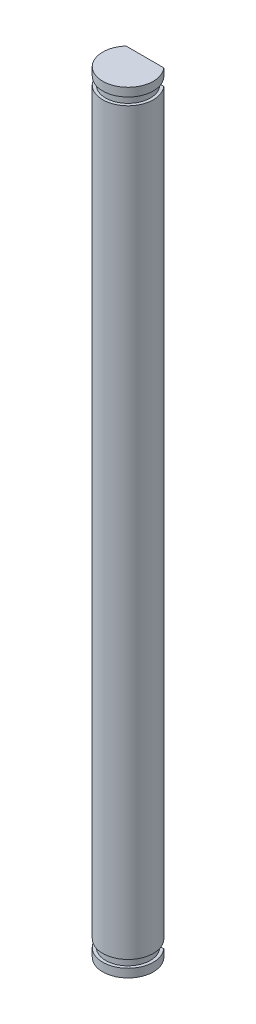
ISO-10303-21;
HEADER;
FILE_DESCRIPTION(('STEP AP214'),'2;1');
FILE_NAME('part.step','',(''),(''),'','','');
FILE_SCHEMA(('AUTOMOTIVE_DESIGN { 1 0 10303 214 1 1 1 1 }'));
ENDSEC;
DATA;
#1=APPLICATION_CONTEXT('core data for automotive mechanical design processes');
#2=APPLICATION_PROTOCOL_DEFINITION('international standard','automotive_design',2000,#1);
#3=PRODUCT_CONTEXT('',#1,'mechanical');
#4=PRODUCT('Part','Part','',(#3));
#5=PRODUCT_RELATED_PRODUCT_CATEGORY('part','',(#4));
#6=PRODUCT_DEFINITION_FORMATION('','',#4);
#7=PRODUCT_DEFINITION_CONTEXT('part definition',#1,'design');
#8=PRODUCT_DEFINITION('design','',#6,#7);
#9=PRODUCT_DEFINITION_SHAPE('','',#8);
#10=(LENGTH_UNIT() NAMED_UNIT(*) SI_UNIT(.MILLI.,.METRE.));
#11=(NAMED_UNIT(*) PLANE_ANGLE_UNIT() SI_UNIT($,.RADIAN.));
#12=(NAMED_UNIT(*) SI_UNIT($,.STERADIAN.) SOLID_ANGLE_UNIT());
#13=UNCERTAINTY_MEASURE_WITH_UNIT(LENGTH_MEASURE(1.E-05),#10,'distance_accuracy_value','');
#14=(GEOMETRIC_REPRESENTATION_CONTEXT(3) GLOBAL_UNCERTAINTY_ASSIGNED_CONTEXT((#13)) GLOBAL_UNIT_ASSIGNED_CONTEXT((#10,
#11,#12)) REPRESENTATION_CONTEXT('',''));
#15=CARTESIAN_POINT('',(0.,0.,0.));
#16=DIRECTION('',(0.,0.,1.));
#17=DIRECTION('',(1.,0.,0.));
#18=AXIS2_PLACEMENT_3D('',#15,#16,#17);
#19=CARTESIAN_POINT('',(0.,45.72,0.));
#20=DIRECTION('',(0.,-1.,0.));
#21=DIRECTION('',(0.,0.,-1.));
#22=AXIS2_PLACEMENT_3D('',#19,#20,#21);
#23=CYLINDRICAL_SURFACE('',#22,3.);
#24=CARTESIAN_POINT('',(0.,43.82,0.));
#25=DIRECTION('',(0.,1.,0.));
#26=DIRECTION('',(-1.,0.,0.));
#27=AXIS2_PLACEMENT_3D('',#24,#25,#26);
#28=CIRCLE('',#27,3.);
#29=CARTESIAN_POINT('',(-2.2360679774998,43.82,-2.));
#30=VERTEX_POINT('',#29);
#31=CARTESIAN_POINT('',(2.2360679774998,43.82,-2.));
#32=VERTEX_POINT('',#31);
#33=EDGE_CURVE('E161',#30,#32,#28,.T.);
#34=ORIENTED_EDGE('',*,*,#33,.F.);
#35=DIRECTION('',(0.,-1.,0.));
#36=VECTOR('',#35,1.);
#37=CARTESIAN_POINT('',(-2.23606797749979,45.72,-2.));
#38=LINE('',#37,#36);
#39=CARTESIAN_POINT('',(-2.23606797749977,-43.82,-2.));
#40=VERTEX_POINT('',#39);
#41=EDGE_CURVE('E163',#30,#40,#38,.T.);
#42=ORIENTED_EDGE('',*,*,#41,.T.);
#43=CARTESIAN_POINT('',(0.,-43.82,0.));
#44=DIRECTION('',(0.,1.,0.));
#45=DIRECTION('',(-1.,0.,0.));
#46=AXIS2_PLACEMENT_3D('',#43,#44,#45);
#47=CIRCLE('',#46,2.99999999999999);
#48=CARTESIAN_POINT('',(2.23606797749979,-43.82,-2.));
#49=VERTEX_POINT('',#48);
#50=EDGE_CURVE('E118',#40,#49,#47,.T.);
#51=ORIENTED_EDGE('',*,*,#50,.T.);
#52=DIRECTION('',(0.,-1.,0.));
#53=VECTOR('',#52,1.);
#54=CARTESIAN_POINT('',(2.23606797749979,45.72,-2.));
#55=LINE('',#54,#53);
#56=EDGE_CURVE('E177',#32,#49,#55,.T.);
#57=ORIENTED_EDGE('',*,*,#56,.F.);
#58=EDGE_LOOP('',(#34,#42,#51,#57));
#59=FACE_BOUND('',#58,.T.);
#60=ADVANCED_FACE('F41',(#59),#23,.T.);
#61=CARTESIAN_POINT('',(0.,44.72,0.));
#62=DIRECTION('',(0.,1.,0.));
#63=DIRECTION('',(-1.,0.,0.));
#64=AXIS2_PLACEMENT_3D('',#61,#62,#63);
#65=CIRCLE('',#64,3.00000000000001);
#66=CARTESIAN_POINT('',(-2.2360679774998,44.72,-2.));
#67=VERTEX_POINT('',#66);
#68=CARTESIAN_POINT('',(2.2360679774998,44.72,-2.));
#69=VERTEX_POINT('',#68);
#70=EDGE_CURVE('E301',#67,#69,#65,.T.);
#71=ORIENTED_EDGE('',*,*,#70,.T.);
#72=CARTESIAN_POINT('',(2.23606797749979,45.72,-2.));
#73=VERTEX_POINT('',#72);
#74=EDGE_CURVE('E175',#73,#69,#55,.T.);
#75=ORIENTED_EDGE('',*,*,#74,.F.);
#76=CARTESIAN_POINT('',(0.,45.72,0.));
#77=DIRECTION('',(0.,1.,0.));
#78=DIRECTION('',(0.,0.,-1.));
#79=AXIS2_PLACEMENT_3D('',#76,#77,#78);
#80=CIRCLE('',#79,3.);
#81=CARTESIAN_POINT('',(-2.23606797749979,45.72,-2.));
#82=VERTEX_POINT('',#81);
#83=EDGE_CURVE('E191',#82,#73,#80,.T.);
#84=ORIENTED_EDGE('',*,*,#83,.F.);
#85=EDGE_CURVE('E165',#82,#67,#38,.T.);
#86=ORIENTED_EDGE('',*,*,#85,.T.);
#87=EDGE_LOOP('',(#71,#75,#84,#86));
#88=FACE_BOUND('',#87,.T.);
#89=ADVANCED_FACE('F212',(#88),#23,.T.);
#90=CARTESIAN_POINT('',(0.,-44.72,0.));
#91=DIRECTION('',(0.,1.,0.));
#92=DIRECTION('',(-1.,0.,0.));
#93=AXIS2_PLACEMENT_3D('',#90,#91,#92);
#94=CIRCLE('',#93,2.99999999999999);
#95=CARTESIAN_POINT('',(-2.23606797749977,-44.72,-2.));
#96=VERTEX_POINT('',#95);
#97=CARTESIAN_POINT('',(2.23606797749979,-44.72,-2.));
#98=VERTEX_POINT('',#97);
#99=EDGE_CURVE('E183',#96,#98,#94,.T.);
#100=ORIENTED_EDGE('',*,*,#99,.F.);
#101=CARTESIAN_POINT('',(-2.23606797749979,-45.72,-2.));
#102=VERTEX_POINT('',#101);
#103=EDGE_CURVE('E166',#96,#102,#38,.T.);
#104=ORIENTED_EDGE('',*,*,#103,.T.);
#105=CARTESIAN_POINT('',(0.,-45.72,0.));
#106=DIRECTION('',(0.,1.,0.));
#107=DIRECTION('',(0.,0.,-1.));
#108=AXIS2_PLACEMENT_3D('',#105,#106,#107);
#109=CIRCLE('',#108,3.);
#110=CARTESIAN_POINT('',(2.23606797749979,-45.72,-2.));
#111=VERTEX_POINT('',#110);
#112=EDGE_CURVE('E160',#102,#111,#109,.T.);
#113=ORIENTED_EDGE('',*,*,#112,.T.);
#114=EDGE_CURVE('E169',#98,#111,#55,.T.);
#115=ORIENTED_EDGE('',*,*,#114,.F.);
#116=EDGE_LOOP('',(#100,#104,#113,#115));
#117=FACE_BOUND('',#116,.T.);
#118=ADVANCED_FACE('F213',(#117),#23,.T.);
#119=CARTESIAN_POINT('',(-2.23606797749979,45.72,-2.));
#120=DIRECTION('',(0.,0.,1.));
#121=DIRECTION('',(1.,0.,0.));
#122=AXIS2_PLACEMENT_3D('',#119,#120,#121);
#123=PLANE('',#122);
#124=DIRECTION('',(-1.,0.,0.));
#125=VECTOR('',#124,1.);
#126=CARTESIAN_POINT('',(-2.23606797749979,43.82,-2.));
#127=LINE('',#126,#125);
#128=CARTESIAN_POINT('',(-1.7385338650714,43.82,-2.));
#129=VERTEX_POINT('',#128);
#130=EDGE_CURVE('E11',#129,#30,#127,.T.);
#131=ORIENTED_EDGE('',*,*,#130,.F.);
#132=DIRECTION('',(0.,1.,0.));
#133=VECTOR('',#132,1.);
#134=CARTESIAN_POINT('',(-1.73853386507139,48.0561399502223,-2.));
#135=LINE('',#134,#133);
#136=CARTESIAN_POINT('',(-1.73853386507138,44.72,-2.));
#137=VERTEX_POINT('',#136);
#138=EDGE_CURVE('E44',#137,#129,#135,.F.);
#139=ORIENTED_EDGE('',*,*,#138,.F.);
#140=DIRECTION('',(1.,0.,0.));
#141=VECTOR('',#140,1.);
#142=CARTESIAN_POINT('',(-2.23606797749979,44.72,-2.));
#143=LINE('',#142,#141);
#144=EDGE_CURVE('E147',#67,#137,#143,.T.);
#145=ORIENTED_EDGE('',*,*,#144,.F.);
#146=ORIENTED_EDGE('',*,*,#85,.F.);
#147=DIRECTION('',(-1.,0.,0.));
#148=VECTOR('',#147,1.);
#149=CARTESIAN_POINT('',(-2.23606797749979,45.72,-2.));
#150=LINE('',#149,#148);
#151=EDGE_CURVE('E170',#73,#82,#150,.T.);
#152=ORIENTED_EDGE('',*,*,#151,.F.);
#153=ORIENTED_EDGE('',*,*,#74,.T.);
#154=CARTESIAN_POINT('',(1.73853386507138,44.72,-2.));
#155=VERTEX_POINT('',#154);
#156=EDGE_CURVE('E141',#155,#69,#143,.T.);
#157=ORIENTED_EDGE('',*,*,#156,.F.);
#158=DIRECTION('',(0.,1.,0.));
#159=VECTOR('',#158,1.);
#160=CARTESIAN_POINT('',(1.73853386507139,48.0561399502223,-2.));
#161=LINE('',#160,#159);
#162=CARTESIAN_POINT('',(1.7385338650714,43.82,-2.));
#163=VERTEX_POINT('',#162);
#164=EDGE_CURVE('E146',#163,#155,#161,.T.);
#165=ORIENTED_EDGE('',*,*,#164,.F.);
#166=EDGE_CURVE('E49',#32,#163,#127,.T.);
#167=ORIENTED_EDGE('',*,*,#166,.F.);
#168=ORIENTED_EDGE('',*,*,#56,.T.);
#169=DIRECTION('',(1.,0.,0.));
#170=VECTOR('',#169,1.);
#171=CARTESIAN_POINT('',(-2.23606797749978,-43.82,-2.));
#172=LINE('',#171,#170);
#173=CARTESIAN_POINT('',(1.73853386507139,-43.82,-2.));
#174=VERTEX_POINT('',#173);
#175=EDGE_CURVE('E126',#174,#49,#172,.T.);
#176=ORIENTED_EDGE('',*,*,#175,.F.);
#177=DIRECTION('',(0.,1.,0.));
#178=VECTOR('',#177,1.);
#179=CARTESIAN_POINT('',(1.73853386507137,48.0561399502223,-2.));
#180=LINE('',#179,#178);
#181=CARTESIAN_POINT('',(1.73853386507137,-44.72,-2.));
#182=VERTEX_POINT('',#181);
#183=EDGE_CURVE('E132',#182,#174,#180,.T.);
#184=ORIENTED_EDGE('',*,*,#183,.F.);
#185=DIRECTION('',(-1.,0.,0.));
#186=VECTOR('',#185,1.);
#187=CARTESIAN_POINT('',(-2.23606797749978,-44.72,-2.));
#188=LINE('',#187,#186);
#189=EDGE_CURVE('E124',#98,#182,#188,.T.);
#190=ORIENTED_EDGE('',*,*,#189,.F.);
#191=ORIENTED_EDGE('',*,*,#114,.T.);
#192=DIRECTION('',(-1.,0.,0.));
#193=VECTOR('',#192,1.);
#194=CARTESIAN_POINT('',(-2.23606797749979,-45.72,-2.));
#195=LINE('',#194,#193);
#196=EDGE_CURVE('E173',#111,#102,#195,.T.);
#197=ORIENTED_EDGE('',*,*,#196,.T.);
#198=ORIENTED_EDGE('',*,*,#103,.F.);
#199=CARTESIAN_POINT('',(-1.73853386507135,-44.72,-2.));
#200=VERTEX_POINT('',#199);
#201=EDGE_CURVE('E139',#200,#96,#188,.T.);
#202=ORIENTED_EDGE('',*,*,#201,.F.);
#203=DIRECTION('',(0.,1.,0.));
#204=VECTOR('',#203,1.);
#205=CARTESIAN_POINT('',(-1.73853386507137,48.0561399502223,-2.));
#206=LINE('',#205,#204);
#207=CARTESIAN_POINT('',(-1.73853386507137,-43.82,-2.));
#208=VERTEX_POINT('',#207);
#209=EDGE_CURVE('E123',#208,#200,#206,.F.);
#210=ORIENTED_EDGE('',*,*,#209,.F.);
#211=EDGE_CURVE('E115',#40,#208,#172,.T.);
#212=ORIENTED_EDGE('',*,*,#211,.F.);
#213=ORIENTED_EDGE('',*,*,#41,.F.);
#214=EDGE_LOOP('',(#131,#139,#145,#146,#152,#153,#157,#165,#167,#168,#176,#184,#190,#191,#197,
#198,#202,#210,#212,#213));
#215=FACE_BOUND('',#214,.T.);
#216=ADVANCED_FACE('F137',(#215),#123,.F.);
#217=CARTESIAN_POINT('',(0.,45.72,0.));
#218=DIRECTION('',(0.,-1.,0.));
#219=DIRECTION('',(0.,0.,-1.));
#220=AXIS2_PLACEMENT_3D('',#217,#218,#219);
#221=PLANE('',#220);
#222=ORIENTED_EDGE('',*,*,#83,.T.);
#223=ORIENTED_EDGE('',*,*,#151,.T.);
#224=EDGE_LOOP('',(#222,#223));
#225=FACE_BOUND('',#224,.T.);
#226=ADVANCED_FACE('F202',(#225),#221,.F.);
#227=CARTESIAN_POINT('',(0.,-45.72,0.));
#228=DIRECTION('',(0.,-1.,0.));
#229=DIRECTION('',(0.,0.,-1.));
#230=AXIS2_PLACEMENT_3D('',#227,#228,#229);
#231=PLANE('',#230);
#232=ORIENTED_EDGE('',*,*,#112,.F.);
#233=ORIENTED_EDGE('',*,*,#196,.F.);
#234=EDGE_LOOP('',(#232,#233));
#235=FACE_BOUND('',#234,.T.);
#236=ADVANCED_FACE('F200',(#235),#231,.T.);
#237=CARTESIAN_POINT('',(0.,48.0561399502223,0.));
#238=DIRECTION('',(0.,1.,0.));
#239=DIRECTION('',(-1.,0.,0.));
#240=AXIS2_PLACEMENT_3D('',#237,#238,#239);
#241=CYLINDRICAL_SURFACE('',#240,2.65);
#242=ORIENTED_EDGE('',*,*,#183,.T.);
#243=CARTESIAN_POINT('',(0.,-43.82,0.));
#244=DIRECTION('',(0.,1.,0.));
#245=DIRECTION('',(-1.,0.,0.));
#246=AXIS2_PLACEMENT_3D('',#243,#244,#245);
#247=CIRCLE('',#246,2.65000000000001);
#248=EDGE_CURVE('E64',#208,#174,#247,.T.);
#249=ORIENTED_EDGE('',*,*,#248,.F.);
#250=ORIENTED_EDGE('',*,*,#209,.T.);
#251=CARTESIAN_POINT('',(0.,-44.72,0.));
#252=DIRECTION('',(0.,1.,0.));
#253=DIRECTION('',(-1.,0.,0.));
#254=AXIS2_PLACEMENT_3D('',#251,#252,#253);
#255=CIRCLE('',#254,2.65);
#256=EDGE_CURVE('E181',#200,#182,#255,.T.);
#257=ORIENTED_EDGE('',*,*,#256,.T.);
#258=EDGE_LOOP('',(#242,#249,#250,#257));
#259=FACE_BOUND('',#258,.T.);
#260=ADVANCED_FACE('F128',(#259),#241,.T.);
#261=CARTESIAN_POINT('',(2.65000000000001,-44.72,0.));
#262=DIRECTION('',(0.,1.,0.));
#263=DIRECTION('',(-1.,0.,0.));
#264=AXIS2_PLACEMENT_3D('',#261,#262,#263);
#265=PLANE('',#264);
#266=ORIENTED_EDGE('',*,*,#189,.T.);
#267=ORIENTED_EDGE('',*,*,#256,.F.);
#268=ORIENTED_EDGE('',*,*,#201,.T.);
#269=ORIENTED_EDGE('',*,*,#99,.T.);
#270=EDGE_LOOP('',(#266,#267,#268,#269));
#271=FACE_BOUND('',#270,.T.);
#272=ADVANCED_FACE('F180',(#271),#265,.T.);
#273=CARTESIAN_POINT('',(2.65000000000002,-43.82,0.));
#274=DIRECTION('',(0.,-1.,0.));
#275=DIRECTION('',(1.,0.,0.));
#276=AXIS2_PLACEMENT_3D('',#273,#274,#275);
#277=PLANE('',#276);
#278=ORIENTED_EDGE('',*,*,#211,.T.);
#279=ORIENTED_EDGE('',*,*,#248,.T.);
#280=ORIENTED_EDGE('',*,*,#175,.T.);
#281=ORIENTED_EDGE('',*,*,#50,.F.);
#282=EDGE_LOOP('',(#278,#279,#280,#281));
#283=FACE_BOUND('',#282,.T.);
#284=ADVANCED_FACE('F116',(#283),#277,.T.);
#285=CARTESIAN_POINT('',(0.,48.0561399502223,0.));
#286=DIRECTION('',(0.,1.,0.));
#287=DIRECTION('',(-1.,0.,0.));
#288=AXIS2_PLACEMENT_3D('',#285,#286,#287);
#289=CYLINDRICAL_SURFACE('',#288,2.65000000000001);
#290=ORIENTED_EDGE('',*,*,#164,.T.);
#291=CARTESIAN_POINT('',(0.,44.72,0.));
#292=DIRECTION('',(0.,1.,0.));
#293=DIRECTION('',(-1.,0.,0.));
#294=AXIS2_PLACEMENT_3D('',#291,#292,#293);
#295=CIRCLE('',#294,2.65000000000001);
#296=EDGE_CURVE('E56',#137,#155,#295,.T.);
#297=ORIENTED_EDGE('',*,*,#296,.F.);
#298=ORIENTED_EDGE('',*,*,#138,.T.);
#299=CARTESIAN_POINT('',(0.,43.82,0.));
#300=DIRECTION('',(0.,1.,0.));
#301=DIRECTION('',(-1.,0.,0.));
#302=AXIS2_PLACEMENT_3D('',#299,#300,#301);
#303=CIRCLE('',#302,2.65000000000002);
#304=EDGE_CURVE('E156',#129,#163,#303,.T.);
#305=ORIENTED_EDGE('',*,*,#304,.T.);
#306=EDGE_LOOP('',(#290,#297,#298,#305));
#307=FACE_BOUND('',#306,.T.);
#308=ADVANCED_FACE('F155',(#307),#289,.T.);
#309=CARTESIAN_POINT('',(2.65000000000002,43.82,0.));
#310=DIRECTION('',(0.,1.,0.));
#311=DIRECTION('',(-1.,0.,0.));
#312=AXIS2_PLACEMENT_3D('',#309,#310,#311);
#313=PLANE('',#312);
#314=ORIENTED_EDGE('',*,*,#166,.T.);
#315=ORIENTED_EDGE('',*,*,#304,.F.);
#316=ORIENTED_EDGE('',*,*,#130,.T.);
#317=ORIENTED_EDGE('',*,*,#33,.T.);
#318=EDGE_LOOP('',(#314,#315,#316,#317));
#319=FACE_BOUND('',#318,.T.);
#320=ADVANCED_FACE('F158',(#319),#313,.T.);
#321=CARTESIAN_POINT('',(2.65000000000001,44.72,0.));
#322=DIRECTION('',(0.,-1.,0.));
#323=DIRECTION('',(1.,0.,0.));
#324=AXIS2_PLACEMENT_3D('',#321,#322,#323);
#325=PLANE('',#324);
#326=ORIENTED_EDGE('',*,*,#144,.T.);
#327=ORIENTED_EDGE('',*,*,#296,.T.);
#328=ORIENTED_EDGE('',*,*,#156,.T.);
#329=ORIENTED_EDGE('',*,*,#70,.F.);
#330=EDGE_LOOP('',(#326,#327,#328,#329));
#331=FACE_BOUND('',#330,.T.);
#332=ADVANCED_FACE('F258',(#331),#325,.T.);
#333=CLOSED_SHELL('',(#60,#89,#118,#216,#226,#236,#260,#272,#284,#308,#320,#332));
#334=MANIFOLD_SOLID_BREP('B2',#333);
#335=ADVANCED_BREP_SHAPE_REPRESENTATION('',(#18,#334),#14);
#336=SHAPE_DEFINITION_REPRESENTATION(#9,#335);
ENDSEC;
END-ISO-10303-21;
